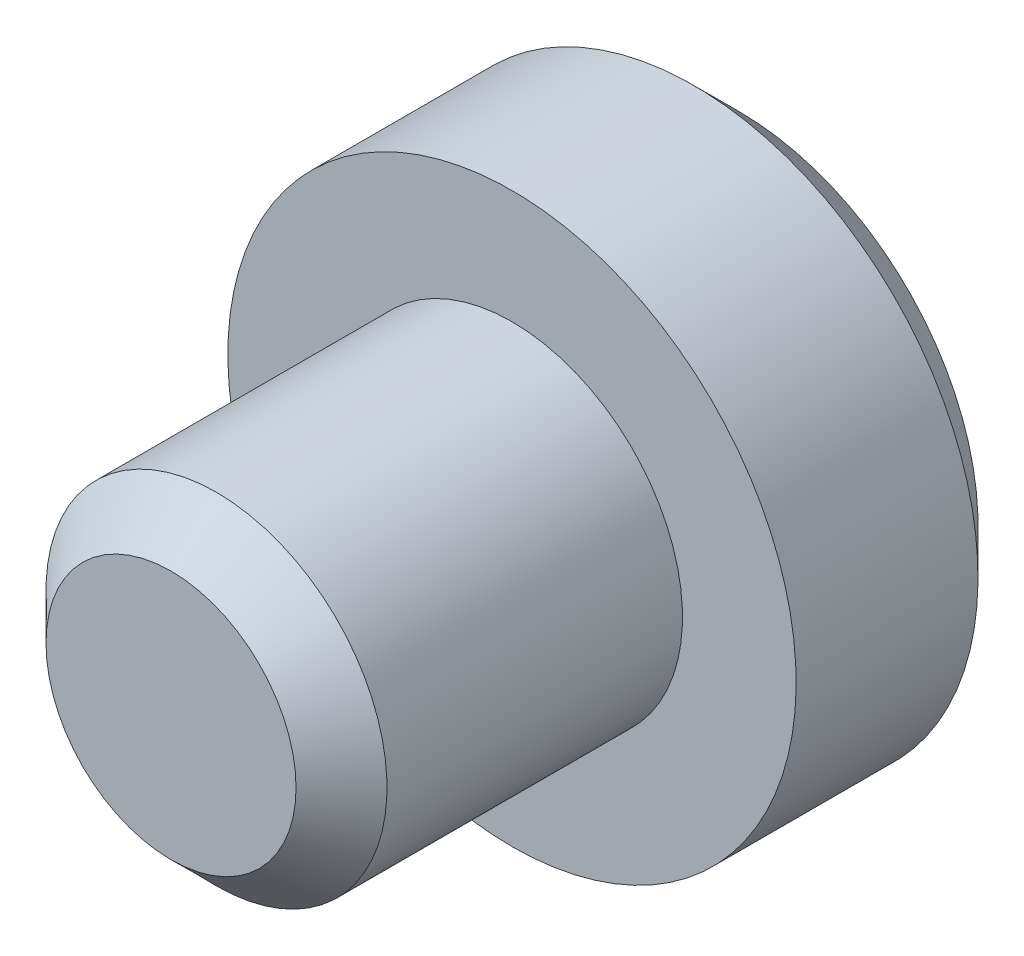
ISO-10303-21;
HEADER;
FILE_DESCRIPTION(('STEP AP214'),'2;1');
FILE_NAME('part.step','',(''),(''),'','','');
FILE_SCHEMA(('AUTOMOTIVE_DESIGN { 1 0 10303 214 1 1 1 1 }'));
ENDSEC;
DATA;
#1=APPLICATION_CONTEXT('core data for automotive mechanical design processes');
#2=APPLICATION_PROTOCOL_DEFINITION('international standard','automotive_design',2000,#1);
#3=PRODUCT_CONTEXT('',#1,'mechanical');
#4=PRODUCT('Part','Part','',(#3));
#5=PRODUCT_RELATED_PRODUCT_CATEGORY('part','',(#4));
#6=PRODUCT_DEFINITION_FORMATION('','',#4);
#7=PRODUCT_DEFINITION_CONTEXT('part definition',#1,'design');
#8=PRODUCT_DEFINITION('design','',#6,#7);
#9=PRODUCT_DEFINITION_SHAPE('','',#8);
#10=(LENGTH_UNIT() NAMED_UNIT(*) SI_UNIT(.MILLI.,.METRE.));
#11=(NAMED_UNIT(*) PLANE_ANGLE_UNIT() SI_UNIT($,.RADIAN.));
#12=(NAMED_UNIT(*) SI_UNIT($,.STERADIAN.) SOLID_ANGLE_UNIT());
#13=UNCERTAINTY_MEASURE_WITH_UNIT(LENGTH_MEASURE(1.E-05),#10,'distance_accuracy_value','');
#14=(GEOMETRIC_REPRESENTATION_CONTEXT(3) GLOBAL_UNCERTAINTY_ASSIGNED_CONTEXT((#13)) GLOBAL_UNIT_ASSIGNED_CONTEXT((#10,
#11,#12)) REPRESENTATION_CONTEXT('',''));
#15=CARTESIAN_POINT('',(0.,0.,0.));
#16=DIRECTION('',(0.,0.,1.));
#17=DIRECTION('',(1.,0.,0.));
#18=AXIS2_PLACEMENT_3D('',#15,#16,#17);
#19=CARTESIAN_POINT('',(0.,0.,0.213149448786225));
#20=DIRECTION('',(0.,0.,1.));
#21=DIRECTION('',(0.,-1.,0.));
#22=AXIS2_PLACEMENT_3D('',#19,#20,#21);
#23=PLANE('',#22);
#24=DIRECTION('',(0.799545155725772,-0.600605980619117,0.));
#25=VECTOR('',#24,1.);
#26=CARTESIAN_POINT('',(-0.644861158138422,-0.858459009305567,0.213149448786225));
#27=LINE('',#26,#25);
#28=CARTESIAN_POINT('',(-1.14049269824925,-0.486148246064415,0.213149448786225));
#29=VERTEX_POINT('',#28);
#30=CARTESIAN_POINT('',(-0.149229618027593,-1.23076977254672,0.213149448786225));
#31=VERTEX_POINT('',#30);
#32=EDGE_CURVE('E197',#29,#31,#27,.T.);
#33=ORIENTED_EDGE('',*,*,#32,.T.);
#34=DIRECTION('',(0.919912614743906,0.392123426021745,0.));
#35=VECTOR('',#34,1.);
#36=CARTESIAN_POINT('',(0.421016731097032,-0.987695649514511,0.213149448786225));
#37=LINE('',#36,#35);
#38=CARTESIAN_POINT('',(0.991263080221657,-0.744621526482303,0.213149448786225));
#39=VERTEX_POINT('',#38);
#40=EDGE_CURVE('E212',#31,#39,#37,.T.);
#41=ORIENTED_EDGE('',*,*,#40,.T.);
#42=DIRECTION('',(0.120367459018134,0.992729406640862,0.));
#43=VECTOR('',#42,1.);
#44=CARTESIAN_POINT('',(1.06587788923545,-0.129236640208944,0.213149448786225));
#45=LINE('',#44,#43);
#46=CARTESIAN_POINT('',(1.14049269824925,0.486148246064414,0.213149448786225));
#47=VERTEX_POINT('',#46);
#48=EDGE_CURVE('E209',#39,#47,#45,.T.);
#49=ORIENTED_EDGE('',*,*,#48,.T.);
#50=DIRECTION('',(-0.799545155725772,0.600605980619117,0.));
#51=VECTOR('',#50,1.);
#52=CARTESIAN_POINT('',(0.644861158138421,0.858459009305566,0.213149448786225));
#53=LINE('',#52,#51);
#54=CARTESIAN_POINT('',(0.149229618027593,1.23076977254672,0.213149448786225));
#55=VERTEX_POINT('',#54);
#56=EDGE_CURVE('E206',#47,#55,#53,.T.);
#57=ORIENTED_EDGE('',*,*,#56,.T.);
#58=DIRECTION('',(-0.919912614743906,-0.392123426021745,0.));
#59=VECTOR('',#58,1.);
#60=CARTESIAN_POINT('',(-0.421016731097032,0.987695649514511,0.213149448786225));
#61=LINE('',#60,#59);
#62=CARTESIAN_POINT('',(-0.991263080221656,0.744621526482304,0.213149448786225));
#63=VERTEX_POINT('',#62);
#64=EDGE_CURVE('E203',#55,#63,#61,.T.);
#65=ORIENTED_EDGE('',*,*,#64,.T.);
#66=DIRECTION('',(-0.120367459018134,-0.992729406640862,0.));
#67=VECTOR('',#66,1.);
#68=CARTESIAN_POINT('',(-1.06587788923545,0.129236640208944,0.213149448786225));
#69=LINE('',#68,#67);
#70=EDGE_CURVE('E200',#63,#29,#69,.T.);
#71=ORIENTED_EDGE('',*,*,#70,.T.);
#72=EDGE_LOOP('',(#33,#41,#49,#57,#65,#71));
#73=FACE_BOUND('',#72,.T.);
#74=CARTESIAN_POINT('',(0.,0.,0.213149448786225));
#75=DIRECTION('',(0.,0.,1.));
#76=DIRECTION('',(0.,-1.,0.));
#77=AXIS2_PLACEMENT_3D('',#74,#75,#76);
#78=CIRCLE('',#77,1.87894736842105);
#79=CARTESIAN_POINT('',(0.,-1.87894736842105,0.213149448786225));
#80=VERTEX_POINT('',#79);
#81=EDGE_CURVE('E189',#80,#80,#78,.F.);
#82=ORIENTED_EDGE('',*,*,#81,.T.);
#83=EDGE_LOOP('',(#82));
#84=FACE_BOUND('',#83,.T.);
#85=ADVANCED_FACE('F43',(#73,#84),#23,.F.);
#86=CARTESIAN_POINT('',(0.,0.,4.68683365931254));
#87=DIRECTION('',(0.,0.,1.));
#88=DIRECTION('',(0.,-1.,0.));
#89=AXIS2_PLACEMENT_3D('',#86,#87,#88);
#90=CYLINDRICAL_SURFACE('',#89,2.23684210526316);
#91=CARTESIAN_POINT('',(0.,0.,0.571044185628328));
#92=DIRECTION('',(0.,0.,1.));
#93=DIRECTION('',(0.,-1.,0.));
#94=AXIS2_PLACEMENT_3D('',#91,#92,#93);
#95=CIRCLE('',#94,2.23684210526316);
#96=CARTESIAN_POINT('',(0.,-2.23684210526316,0.571044185628328));
#97=VERTEX_POINT('',#96);
#98=EDGE_CURVE('E185',#97,#97,#95,.T.);
#99=ORIENTED_EDGE('',*,*,#98,.T.);
#100=EDGE_LOOP('',(#99));
#101=FACE_BOUND('',#100,.T.);
#102=CARTESIAN_POINT('',(0.,0.,2.00262313299675));
#103=DIRECTION('',(0.,0.,1.));
#104=DIRECTION('',(0.,-1.,0.));
#105=AXIS2_PLACEMENT_3D('',#102,#103,#104);
#106=CIRCLE('',#105,2.23684210526316);
#107=CARTESIAN_POINT('',(0.,-2.23684210526316,2.00262313299675));
#108=VERTEX_POINT('',#107);
#109=EDGE_CURVE('E173',#108,#108,#106,.T.);
#110=ORIENTED_EDGE('',*,*,#109,.F.);
#111=EDGE_LOOP('',(#110));
#112=FACE_BOUND('',#111,.T.);
#113=ADVANCED_FACE('F290',(#101,#112),#90,.T.);
#114=CARTESIAN_POINT('',(0.,2.23684210526316,2.00262313299675));
#115=DIRECTION('',(0.,0.,-1.));
#116=DIRECTION('',(0.,1.,0.));
#117=AXIS2_PLACEMENT_3D('',#114,#115,#116);
#118=PLANE('',#117);
#119=CARTESIAN_POINT('',(0.,0.,2.00262313299675));
#120=DIRECTION('',(0.,0.,1.));
#121=DIRECTION('',(0.,-1.,0.));
#122=AXIS2_PLACEMENT_3D('',#119,#120,#121);
#123=CIRCLE('',#122,1.34210526315789);
#124=CARTESIAN_POINT('',(0.,-1.34210526315789,2.00262313299675));
#125=VERTEX_POINT('',#124);
#126=EDGE_CURVE('E155',#125,#125,#123,.T.);
#127=ORIENTED_EDGE('',*,*,#126,.F.);
#128=EDGE_LOOP('',(#127));
#129=FACE_BOUND('',#128,.T.);
#130=ORIENTED_EDGE('',*,*,#109,.T.);
#131=EDGE_LOOP('',(#130));
#132=FACE_BOUND('',#131,.T.);
#133=ADVANCED_FACE('F295',(#129,#132),#118,.F.);
#134=CARTESIAN_POINT('',(0.,0.,4.68683365931254));
#135=DIRECTION('',(0.,0.,1.));
#136=DIRECTION('',(0.,-1.,0.));
#137=AXIS2_PLACEMENT_3D('',#134,#135,#136);
#138=CYLINDRICAL_SURFACE('',#137,1.34210526315789);
#139=CARTESIAN_POINT('',(0.,0.,4.32893892247043));
#140=DIRECTION('',(0.,0.,-1.));
#141=DIRECTION('',(0.,1.,0.));
#142=AXIS2_PLACEMENT_3D('',#139,#140,#141);
#143=CIRCLE('',#142,1.34210526315789);
#144=CARTESIAN_POINT('',(0.,1.34210526315789,4.32893892247043));
#145=VERTEX_POINT('',#144);
#146=EDGE_CURVE('E181',#145,#145,#143,.T.);
#147=ORIENTED_EDGE('',*,*,#146,.T.);
#148=EDGE_LOOP('',(#147));
#149=FACE_BOUND('',#148,.T.);
#150=ORIENTED_EDGE('',*,*,#126,.T.);
#151=EDGE_LOOP('',(#150));
#152=FACE_BOUND('',#151,.T.);
#153=ADVANCED_FACE('F371',(#149,#152),#138,.T.);
#154=CARTESIAN_POINT('',(0.,1.34210526315789,4.68683365931254));
#155=DIRECTION('',(0.,0.,-1.));
#156=DIRECTION('',(0.,1.,0.));
#157=AXIS2_PLACEMENT_3D('',#154,#155,#156);
#158=PLANE('',#157);
#159=CARTESIAN_POINT('',(0.,0.,4.68683365931254));
#160=DIRECTION('',(0.,0.,-1.));
#161=DIRECTION('',(0.,1.,0.));
#162=AXIS2_PLACEMENT_3D('',#159,#160,#161);
#163=CIRCLE('',#162,0.98421052631579);
#164=CARTESIAN_POINT('',(0.,0.98421052631579,4.68683365931254));
#165=VERTEX_POINT('',#164);
#166=EDGE_CURVE('E177',#165,#165,#163,.F.);
#167=ORIENTED_EDGE('',*,*,#166,.T.);
#168=EDGE_LOOP('',(#167));
#169=FACE_BOUND('',#168,.T.);
#170=ADVANCED_FACE('F364',(#169),#158,.F.);
#171=CARTESIAN_POINT('',(-0.136793816525293,-1.12820562483449,2.00262313299675));
#172=DIRECTION('',(-0.600605980619117,-0.799545155725772,0.));
#173=DIRECTION('',(0.799545155725772,-0.600605980619117,0.));
#174=AXIS2_PLACEMENT_3D('',#171,#172,#173);
#175=PLANE('',#174);
#176=DIRECTION('',(0.,0.,-1.));
#177=VECTOR('',#176,1.);
#178=CARTESIAN_POINT('',(-0.136793816525293,-1.12820562483449,2.00262313299675));
#179=LINE('',#178,#177);
#180=CARTESIAN_POINT('',(-0.136793816525293,-1.12820562483449,2.00262313299675));
#181=VERTEX_POINT('',#180);
#182=CARTESIAN_POINT('',(-0.136793816525293,-1.12820562483449,0.302623132996753));
#183=VERTEX_POINT('',#182);
#184=EDGE_CURVE('E152',#181,#183,#179,.T.);
#185=ORIENTED_EDGE('',*,*,#184,.T.);
#186=DIRECTION('',(-0.799545155725772,0.600605980619117,0.));
#187=VECTOR('',#186,1.);
#188=CARTESIAN_POINT('',(-0.136793816525293,-1.12820562483449,0.302623132996753));
#189=LINE('',#188,#187);
#190=CARTESIAN_POINT('',(-1.04545164006181,-0.445635892225713,0.302623132996753));
#191=VERTEX_POINT('',#190);
#192=EDGE_CURVE('E12',#183,#191,#189,.T.);
#193=ORIENTED_EDGE('',*,*,#192,.T.);
#194=DIRECTION('',(0.,0.,-1.));
#195=VECTOR('',#194,1.);
#196=CARTESIAN_POINT('',(-1.04545164006181,-0.445635892225713,2.00262313299675));
#197=LINE('',#196,#195);
#198=CARTESIAN_POINT('',(-1.04545164006181,-0.445635892225713,2.00262313299675));
#199=VERTEX_POINT('',#198);
#200=EDGE_CURVE('E113',#199,#191,#197,.T.);
#201=ORIENTED_EDGE('',*,*,#200,.F.);
#202=DIRECTION('',(-0.799545155725772,0.600605980619117,0.));
#203=VECTOR('',#202,1.);
#204=CARTESIAN_POINT('',(-0.136793816525293,-1.12820562483449,2.00262313299675));
#205=LINE('',#204,#203);
#206=EDGE_CURVE('E117',#181,#199,#205,.T.);
#207=ORIENTED_EDGE('',*,*,#206,.F.);
#208=EDGE_LOOP('',(#185,#193,#201,#207));
#209=FACE_BOUND('',#208,.T.);
#210=ADVANCED_FACE('F115',(#209),#175,.F.);
#211=CARTESIAN_POINT('',(0.908657823536518,-0.682569732608777,2.00262313299675));
#212=DIRECTION('',(0.392123426021745,-0.919912614743906,0.));
#213=DIRECTION('',(0.919912614743906,0.392123426021745,0.));
#214=AXIS2_PLACEMENT_3D('',#211,#212,#213);
#215=PLANE('',#214);
#216=DIRECTION('',(0.,0.,-1.));
#217=VECTOR('',#216,1.);
#218=CARTESIAN_POINT('',(0.908657823536518,-0.682569732608777,2.00262313299675));
#219=LINE('',#218,#217);
#220=CARTESIAN_POINT('',(0.908657823536518,-0.682569732608777,2.00262313299675));
#221=VERTEX_POINT('',#220);
#222=CARTESIAN_POINT('',(0.908657823536518,-0.682569732608777,0.302623132996753));
#223=VERTEX_POINT('',#222);
#224=EDGE_CURVE('E156',#221,#223,#219,.T.);
#225=ORIENTED_EDGE('',*,*,#224,.T.);
#226=DIRECTION('',(-0.919912614743906,-0.392123426021745,0.));
#227=VECTOR('',#226,1.);
#228=CARTESIAN_POINT('',(0.908657823536518,-0.682569732608777,0.302623132996753));
#229=LINE('',#228,#227);
#230=EDGE_CURVE('E193',#223,#183,#229,.T.);
#231=ORIENTED_EDGE('',*,*,#230,.T.);
#232=ORIENTED_EDGE('',*,*,#184,.F.);
#233=DIRECTION('',(-0.919912614743906,-0.392123426021745,0.));
#234=VECTOR('',#233,1.);
#235=CARTESIAN_POINT('',(0.908657823536518,-0.682569732608777,2.00262313299675));
#236=LINE('',#235,#234);
#237=EDGE_CURVE('E121',#221,#181,#236,.T.);
#238=ORIENTED_EDGE('',*,*,#237,.F.);
#239=EDGE_LOOP('',(#225,#231,#232,#238));
#240=FACE_BOUND('',#239,.T.);
#241=ADVANCED_FACE('F260',(#240),#215,.F.);
#242=CARTESIAN_POINT('',(1.04545164006181,0.445635892225713,2.00262313299675));
#243=DIRECTION('',(0.992729406640862,-0.120367459018134,0.));
#244=DIRECTION('',(0.120367459018134,0.992729406640862,0.));
#245=AXIS2_PLACEMENT_3D('',#242,#243,#244);
#246=PLANE('',#245);
#247=DIRECTION('',(0.,0.,-1.));
#248=VECTOR('',#247,1.);
#249=CARTESIAN_POINT('',(1.04545164006181,0.445635892225713,2.00262313299675));
#250=LINE('',#249,#248);
#251=CARTESIAN_POINT('',(1.04545164006181,0.445635892225713,2.00262313299675));
#252=VERTEX_POINT('',#251);
#253=CARTESIAN_POINT('',(1.04545164006181,0.445635892225713,0.302623132996753));
#254=VERTEX_POINT('',#253);
#255=EDGE_CURVE('E160',#252,#254,#250,.T.);
#256=ORIENTED_EDGE('',*,*,#255,.T.);
#257=DIRECTION('',(-0.120367459018134,-0.992729406640862,0.));
#258=VECTOR('',#257,1.);
#259=CARTESIAN_POINT('',(1.04545164006181,0.445635892225713,0.302623132996753));
#260=LINE('',#259,#258);
#261=EDGE_CURVE('E216',#254,#223,#260,.T.);
#262=ORIENTED_EDGE('',*,*,#261,.T.);
#263=ORIENTED_EDGE('',*,*,#224,.F.);
#264=DIRECTION('',(-0.120367459018134,-0.992729406640862,0.));
#265=VECTOR('',#264,1.);
#266=CARTESIAN_POINT('',(1.04545164006181,0.445635892225713,2.00262313299675));
#267=LINE('',#266,#265);
#268=EDGE_CURVE('E147',#252,#221,#267,.T.);
#269=ORIENTED_EDGE('',*,*,#268,.F.);
#270=EDGE_LOOP('',(#256,#262,#263,#269));
#271=FACE_BOUND('',#270,.T.);
#272=ADVANCED_FACE('F280',(#271),#246,.F.);
#273=CARTESIAN_POINT('',(0.136793816525293,1.12820562483449,2.00262313299675));
#274=DIRECTION('',(0.600605980619117,0.799545155725772,0.));
#275=DIRECTION('',(-0.799545155725772,0.600605980619117,0.));
#276=AXIS2_PLACEMENT_3D('',#273,#274,#275);
#277=PLANE('',#276);
#278=DIRECTION('',(0.,0.,-1.));
#279=VECTOR('',#278,1.);
#280=CARTESIAN_POINT('',(0.136793816525293,1.12820562483449,2.00262313299675));
#281=LINE('',#280,#279);
#282=CARTESIAN_POINT('',(0.136793816525293,1.12820562483449,2.00262313299675));
#283=VERTEX_POINT('',#282);
#284=CARTESIAN_POINT('',(0.136793816525293,1.12820562483449,0.302623132996753));
#285=VERTEX_POINT('',#284);
#286=EDGE_CURVE('E164',#283,#285,#281,.T.);
#287=ORIENTED_EDGE('',*,*,#286,.T.);
#288=DIRECTION('',(0.799545155725772,-0.600605980619117,0.));
#289=VECTOR('',#288,1.);
#290=CARTESIAN_POINT('',(0.136793816525293,1.12820562483449,0.302623132996753));
#291=LINE('',#290,#289);
#292=EDGE_CURVE('E219',#285,#254,#291,.T.);
#293=ORIENTED_EDGE('',*,*,#292,.T.);
#294=ORIENTED_EDGE('',*,*,#255,.F.);
#295=DIRECTION('',(0.799545155725772,-0.600605980619117,0.));
#296=VECTOR('',#295,1.);
#297=CARTESIAN_POINT('',(0.136793816525293,1.12820562483449,2.00262313299675));
#298=LINE('',#297,#296);
#299=EDGE_CURVE('E143',#283,#252,#298,.T.);
#300=ORIENTED_EDGE('',*,*,#299,.F.);
#301=EDGE_LOOP('',(#287,#293,#294,#300));
#302=FACE_BOUND('',#301,.T.);
#303=ADVANCED_FACE('F256',(#302),#277,.F.);
#304=CARTESIAN_POINT('',(-0.908657823536517,0.682569732608778,2.00262313299675));
#305=DIRECTION('',(-0.392123426021745,0.919912614743906,0.));
#306=DIRECTION('',(-0.919912614743906,-0.392123426021745,0.));
#307=AXIS2_PLACEMENT_3D('',#304,#305,#306);
#308=PLANE('',#307);
#309=DIRECTION('',(0.,0.,-1.));
#310=VECTOR('',#309,1.);
#311=CARTESIAN_POINT('',(-0.908657823536517,0.682569732608778,2.00262313299675));
#312=LINE('',#311,#310);
#313=CARTESIAN_POINT('',(-0.908657823536517,0.682569732608778,2.00262313299675));
#314=VERTEX_POINT('',#313);
#315=CARTESIAN_POINT('',(-0.908657823536517,0.682569732608778,0.302623132996753));
#316=VERTEX_POINT('',#315);
#317=EDGE_CURVE('E120',#314,#316,#312,.T.);
#318=ORIENTED_EDGE('',*,*,#317,.T.);
#319=DIRECTION('',(0.919912614743906,0.392123426021745,0.));
#320=VECTOR('',#319,1.);
#321=CARTESIAN_POINT('',(-0.908657823536517,0.682569732608778,0.302623132996753));
#322=LINE('',#321,#320);
#323=EDGE_CURVE('E222',#316,#285,#322,.T.);
#324=ORIENTED_EDGE('',*,*,#323,.T.);
#325=ORIENTED_EDGE('',*,*,#286,.F.);
#326=DIRECTION('',(0.919912614743906,0.392123426021745,0.));
#327=VECTOR('',#326,1.);
#328=CARTESIAN_POINT('',(-0.908657823536517,0.682569732608778,2.00262313299675));
#329=LINE('',#328,#327);
#330=EDGE_CURVE('E130',#314,#283,#329,.T.);
#331=ORIENTED_EDGE('',*,*,#330,.F.);
#332=EDGE_LOOP('',(#318,#324,#325,#331));
#333=FACE_BOUND('',#332,.T.);
#334=ADVANCED_FACE('F253',(#333),#308,.F.);
#335=CARTESIAN_POINT('',(-1.04545164006181,-0.445635892225713,2.00262313299675));
#336=DIRECTION('',(-0.992729406640862,0.120367459018134,0.));
#337=DIRECTION('',(-0.120367459018134,-0.992729406640862,0.));
#338=AXIS2_PLACEMENT_3D('',#335,#336,#337);
#339=PLANE('',#338);
#340=ORIENTED_EDGE('',*,*,#200,.T.);
#341=DIRECTION('',(0.120367459018134,0.992729406640862,0.));
#342=VECTOR('',#341,1.);
#343=CARTESIAN_POINT('',(-1.04545164006181,-0.445635892225713,0.302623132996753));
#344=LINE('',#343,#342);
#345=EDGE_CURVE('E53',#191,#316,#344,.T.);
#346=ORIENTED_EDGE('',*,*,#345,.T.);
#347=ORIENTED_EDGE('',*,*,#317,.F.);
#348=DIRECTION('',(0.120367459018134,0.992729406640862,0.));
#349=VECTOR('',#348,1.);
#350=CARTESIAN_POINT('',(-1.04545164006181,-0.445635892225713,2.00262313299675));
#351=LINE('',#350,#349);
#352=EDGE_CURVE('E124',#199,#314,#351,.T.);
#353=ORIENTED_EDGE('',*,*,#352,.F.);
#354=EDGE_LOOP('',(#340,#346,#347,#353));
#355=FACE_BOUND('',#354,.T.);
#356=ADVANCED_FACE('F125',(#355),#339,.F.);
#357=CARTESIAN_POINT('',(0.,0.,2.00262313299675));
#358=DIRECTION('',(0.,0.,-1.));
#359=DIRECTION('',(0.,1.,0.));
#360=AXIS2_PLACEMENT_3D('',#357,#358,#359);
#361=PLANE('',#360);
#362=ORIENTED_EDGE('',*,*,#206,.T.);
#363=ORIENTED_EDGE('',*,*,#352,.T.);
#364=ORIENTED_EDGE('',*,*,#330,.T.);
#365=ORIENTED_EDGE('',*,*,#299,.T.);
#366=ORIENTED_EDGE('',*,*,#268,.T.);
#367=ORIENTED_EDGE('',*,*,#237,.T.);
#368=EDGE_LOOP('',(#362,#363,#364,#365,#366,#367));
#369=FACE_BOUND('',#368,.T.);
#370=ADVANCED_FACE('F132',(#369),#361,.T.);
#371=CARTESIAN_POINT('',(0.,0.,4.68683365931254));
#372=DIRECTION('',(0.,0.,-1.));
#373=DIRECTION('',(0.,1.,0.));
#374=AXIS2_PLACEMENT_3D('',#371,#372,#373);
#375=CONICAL_SURFACE('',#374,0.98421052631579,0.785398163397447);
#376=ORIENTED_EDGE('',*,*,#146,.F.);
#377=EDGE_LOOP('',(#376));
#378=FACE_BOUND('',#377,.T.);
#379=ORIENTED_EDGE('',*,*,#166,.F.);
#380=EDGE_LOOP('',(#379));
#381=FACE_BOUND('',#380,.T.);
#382=ADVANCED_FACE('F300',(#378,#381),#375,.T.);
#383=CARTESIAN_POINT('',(0.,0.,0.571044185628328));
#384=DIRECTION('',(0.,0.,1.));
#385=DIRECTION('',(0.,-1.,0.));
#386=AXIS2_PLACEMENT_3D('',#383,#384,#385);
#387=CONICAL_SURFACE('',#386,2.23684210526316,0.78539816339745);
#388=ORIENTED_EDGE('',*,*,#81,.F.);
#389=EDGE_LOOP('',(#388));
#390=FACE_BOUND('',#389,.T.);
#391=ORIENTED_EDGE('',*,*,#98,.F.);
#392=EDGE_LOOP('',(#391));
#393=FACE_BOUND('',#392,.T.);
#394=ADVANCED_FACE('F303',(#390,#393),#387,.T.);
#395=CARTESIAN_POINT('',(-0.908657823536517,0.682569732608778,0.302623132996753));
#396=DIRECTION('',(-0.277273133602077,0.650476447984463,0.707106781186548));
#397=DIRECTION('',(0.919912614743906,0.392123426021745,0.));
#398=AXIS2_PLACEMENT_3D('',#395,#396,#397);
#399=PLANE('',#398);
#400=DIRECTION('',(0.604399326861942,-0.454015445901791,0.654653670707977));
#401=VECTOR('',#400,1.);
#402=CARTESIAN_POINT('',(-0.908657823536517,0.682569732608778,0.302623132996753));
#403=LINE('',#402,#401);
#404=EDGE_CURVE('E139',#63,#316,#403,.T.);
#405=ORIENTED_EDGE('',*,*,#404,.F.);
#406=ORIENTED_EDGE('',*,*,#64,.F.);
#407=DIRECTION('',(-0.090989246430495,-0.750432894043553,0.654653670707977));
#408=VECTOR('',#407,1.);
#409=CARTESIAN_POINT('',(0.136793816525293,1.12820562483449,0.302623132996753));
#410=LINE('',#409,#408);
#411=EDGE_CURVE('E47',#285,#55,#410,.F.);
#412=ORIENTED_EDGE('',*,*,#411,.F.);
#413=ORIENTED_EDGE('',*,*,#323,.F.);
#414=EDGE_LOOP('',(#405,#406,#412,#413));
#415=FACE_BOUND('',#414,.T.);
#416=ADVANCED_FACE('F45',(#415),#399,.F.);
#417=CARTESIAN_POINT('',(0.136793816525293,1.12820562483449,0.302623132996753));
#418=DIRECTION('',(0.424692561716974,0.565363801478548,0.707106781186547));
#419=DIRECTION('',(0.799545155725772,-0.600605980619117,0.));
#420=AXIS2_PLACEMENT_3D('',#417,#418,#419);
#421=PLANE('',#420);
#422=ORIENTED_EDGE('',*,*,#411,.T.);
#423=ORIENTED_EDGE('',*,*,#56,.F.);
#424=DIRECTION('',(-0.695388573292441,-0.296417448141762,0.654653670707978));
#425=VECTOR('',#424,1.);
#426=CARTESIAN_POINT('',(1.04545164006181,0.445635892225713,0.302623132996753));
#427=LINE('',#426,#425);
#428=EDGE_CURVE('E237',#254,#47,#427,.F.);
#429=ORIENTED_EDGE('',*,*,#428,.F.);
#430=ORIENTED_EDGE('',*,*,#292,.F.);
#431=EDGE_LOOP('',(#422,#423,#429,#430));
#432=FACE_BOUND('',#431,.T.);
#433=ADVANCED_FACE('F276',(#432),#421,.F.);
#434=CARTESIAN_POINT('',(-1.04545164006181,-0.445635892225713,0.302623132996753));
#435=DIRECTION('',(-0.701965695319052,0.0851126465059164,0.707106781186547));
#436=DIRECTION('',(0.120367459018134,0.992729406640862,0.));
#437=AXIS2_PLACEMENT_3D('',#434,#435,#436);
#438=PLANE('',#437);
#439=ORIENTED_EDGE('',*,*,#404,.T.);
#440=ORIENTED_EDGE('',*,*,#345,.F.);
#441=DIRECTION('',(0.69538857329244,0.296417448141765,0.654653670707977));
#442=VECTOR('',#441,1.);
#443=CARTESIAN_POINT('',(-1.04545164006181,-0.445635892225713,0.302623132996753));
#444=LINE('',#443,#442);
#445=EDGE_CURVE('E233',#29,#191,#444,.T.);
#446=ORIENTED_EDGE('',*,*,#445,.F.);
#447=ORIENTED_EDGE('',*,*,#70,.F.);
#448=EDGE_LOOP('',(#439,#440,#446,#447));
#449=FACE_BOUND('',#448,.T.);
#450=ADVANCED_FACE('F245',(#449),#438,.F.);
#451=CARTESIAN_POINT('',(1.04545164006181,0.445635892225713,0.302623132996753));
#452=DIRECTION('',(0.701965695319051,-0.0851126465059164,0.707106781186547));
#453=DIRECTION('',(-0.120367459018134,-0.992729406640862,0.));
#454=AXIS2_PLACEMENT_3D('',#451,#452,#453);
#455=PLANE('',#454);
#456=ORIENTED_EDGE('',*,*,#428,.T.);
#457=ORIENTED_EDGE('',*,*,#48,.F.);
#458=DIRECTION('',(-0.604399326861942,0.454015445901792,0.654653670707977));
#459=VECTOR('',#458,1.);
#460=CARTESIAN_POINT('',(0.908657823536518,-0.682569732608777,0.302623132996753));
#461=LINE('',#460,#459);
#462=EDGE_CURVE('E230',#223,#39,#461,.F.);
#463=ORIENTED_EDGE('',*,*,#462,.F.);
#464=ORIENTED_EDGE('',*,*,#261,.F.);
#465=EDGE_LOOP('',(#456,#457,#463,#464));
#466=FACE_BOUND('',#465,.T.);
#467=ADVANCED_FACE('F279',(#466),#455,.F.);
#468=CARTESIAN_POINT('',(-0.136793816525293,-1.12820562483449,0.302623132996753));
#469=DIRECTION('',(-0.424692561716974,-0.565363801478547,0.707106781186548));
#470=DIRECTION('',(-0.799545155725772,0.600605980619117,0.));
#471=AXIS2_PLACEMENT_3D('',#468,#469,#470);
#472=PLANE('',#471);
#473=ORIENTED_EDGE('',*,*,#445,.T.);
#474=ORIENTED_EDGE('',*,*,#192,.F.);
#475=DIRECTION('',(-0.0909892464304957,-0.750432894043554,-0.654653670707976));
#476=VECTOR('',#475,1.);
#477=CARTESIAN_POINT('',(-0.0977098689466388,-0.805861160596065,0.583826140515548));
#478=LINE('',#477,#476);
#479=EDGE_CURVE('E227',#31,#183,#478,.F.);
#480=ORIENTED_EDGE('',*,*,#479,.F.);
#481=ORIENTED_EDGE('',*,*,#32,.F.);
#482=EDGE_LOOP('',(#473,#474,#480,#481));
#483=FACE_BOUND('',#482,.T.);
#484=ADVANCED_FACE('F270',(#483),#472,.F.);
#485=CARTESIAN_POINT('',(0.908657823536518,-0.682569732608777,0.302623132996753));
#486=DIRECTION('',(0.277273133602077,-0.650476447984462,0.707106781186549));
#487=DIRECTION('',(-0.919912614743906,-0.392123426021745,0.));
#488=AXIS2_PLACEMENT_3D('',#485,#486,#487);
#489=PLANE('',#488);
#490=ORIENTED_EDGE('',*,*,#462,.T.);
#491=ORIENTED_EDGE('',*,*,#40,.F.);
#492=ORIENTED_EDGE('',*,*,#479,.T.);
#493=ORIENTED_EDGE('',*,*,#230,.F.);
#494=EDGE_LOOP('',(#490,#491,#492,#493));
#495=FACE_BOUND('',#494,.T.);
#496=ADVANCED_FACE('F264',(#495),#489,.F.);
#497=CLOSED_SHELL('',(#85,#113,#133,#153,#170,#210,#241,#272,#303,#334,#356,#370,#382,#394,#416,
#433,#450,#467,#484,#496));
#498=MANIFOLD_SOLID_BREP('B2',#497);
#499=ADVANCED_BREP_SHAPE_REPRESENTATION('',(#18,#498),#14);
#500=SHAPE_DEFINITION_REPRESENTATION(#9,#499);
ENDSEC;
END-ISO-10303-21;
